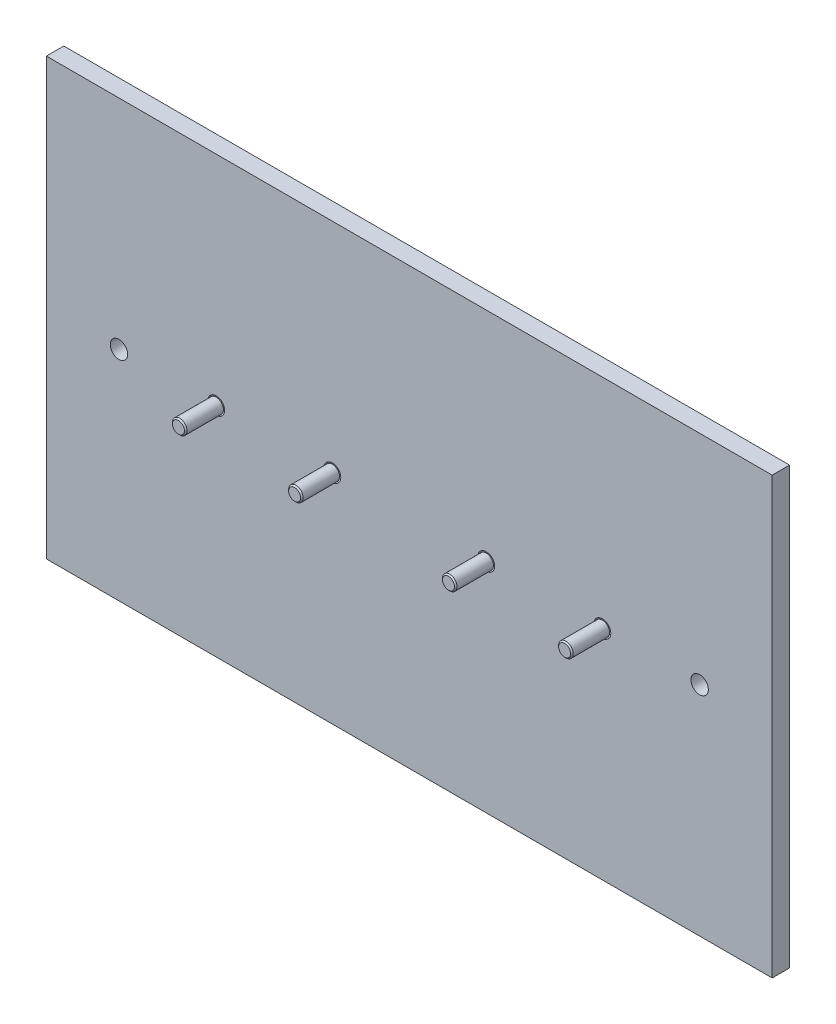
ISO-10303-21;
HEADER;
FILE_DESCRIPTION(('STEP AP214'),'2;1');
FILE_NAME('part.step','',(''),(''),'','','');
FILE_SCHEMA(('AUTOMOTIVE_DESIGN { 1 0 10303 214 1 1 1 1 }'));
ENDSEC;
DATA;
#1=APPLICATION_CONTEXT('core data for automotive mechanical design processes');
#2=APPLICATION_PROTOCOL_DEFINITION('international standard','automotive_design',2000,#1);
#3=PRODUCT_CONTEXT('',#1,'mechanical');
#4=PRODUCT('Part','Part','',(#3));
#5=PRODUCT_RELATED_PRODUCT_CATEGORY('part','',(#4));
#6=PRODUCT_DEFINITION_FORMATION('','',#4);
#7=PRODUCT_DEFINITION_CONTEXT('part definition',#1,'design');
#8=PRODUCT_DEFINITION('design','',#6,#7);
#9=PRODUCT_DEFINITION_SHAPE('','',#8);
#10=(LENGTH_UNIT() NAMED_UNIT(*) SI_UNIT(.MILLI.,.METRE.));
#11=(NAMED_UNIT(*) PLANE_ANGLE_UNIT() SI_UNIT($,.RADIAN.));
#12=(NAMED_UNIT(*) SI_UNIT($,.STERADIAN.) SOLID_ANGLE_UNIT());
#13=UNCERTAINTY_MEASURE_WITH_UNIT(LENGTH_MEASURE(1.E-05),#10,'distance_accuracy_value','');
#14=(GEOMETRIC_REPRESENTATION_CONTEXT(3) GLOBAL_UNCERTAINTY_ASSIGNED_CONTEXT((#13)) GLOBAL_UNIT_ASSIGNED_CONTEXT((#10,
#11,#12)) REPRESENTATION_CONTEXT('',''));
#15=CARTESIAN_POINT('',(0.,0.,0.));
#16=DIRECTION('',(0.,0.,1.));
#17=DIRECTION('',(1.,0.,0.));
#18=AXIS2_PLACEMENT_3D('',#15,#16,#17);
#19=CARTESIAN_POINT('',(98.5,75.,0.));
#20=DIRECTION('',(0.,0.,1.));
#21=DIRECTION('',(1.,0.,0.));
#22=AXIS2_PLACEMENT_3D('',#19,#20,#21);
#23=PLANE('',#22);
#24=CARTESIAN_POINT('',(98.5,75.,0.));
#25=DIRECTION('',(0.,0.,-1.));
#26=DIRECTION('',(-1.,0.,0.));
#27=AXIS2_PLACEMENT_3D('',#24,#25,#26);
#28=CIRCLE('',#27,2.5);
#29=CARTESIAN_POINT('',(96.,75.,0.));
#30=VERTEX_POINT('',#29);
#31=EDGE_CURVE('E11',#30,#30,#28,.T.);
#32=ORIENTED_EDGE('',*,*,#31,.T.);
#33=EDGE_LOOP('',(#32));
#34=FACE_BOUND('',#33,.T.);
#35=ADVANCED_FACE('F54',(#34),#23,.F.);
#36=CARTESIAN_POINT('',(98.5,75.,13.));
#37=DIRECTION('',(0.,0.,-1.));
#38=DIRECTION('',(-1.,0.,0.));
#39=AXIS2_PLACEMENT_3D('',#36,#37,#38);
#40=CYLINDRICAL_SURFACE('',#39,2.5);
#41=ORIENTED_EDGE('',*,*,#31,.F.);
#42=EDGE_LOOP('',(#41));
#43=FACE_BOUND('',#42,.T.);
#44=CARTESIAN_POINT('',(98.5,75.,12.555));
#45=DIRECTION('',(0.,0.,-1.));
#46=DIRECTION('',(-1.,0.,0.));
#47=AXIS2_PLACEMENT_3D('',#44,#45,#46);
#48=CIRCLE('',#47,2.5);
#49=CARTESIAN_POINT('',(96.,75.,12.555));
#50=VERTEX_POINT('',#49);
#51=EDGE_CURVE('E68',#50,#50,#48,.T.);
#52=ORIENTED_EDGE('',*,*,#51,.T.);
#53=EDGE_LOOP('',(#52));
#54=FACE_BOUND('',#53,.T.);
#55=ADVANCED_FACE('F78',(#43,#54),#40,.T.);
#56=CARTESIAN_POINT('',(98.5,75.,13.));
#57=DIRECTION('',(0.,0.,-1.));
#58=DIRECTION('',(-1.,0.,0.));
#59=AXIS2_PLACEMENT_3D('',#56,#57,#58);
#60=CONICAL_SURFACE('',#59,2.055,0.785398163397452);
#61=ORIENTED_EDGE('',*,*,#51,.F.);
#62=EDGE_LOOP('',(#61));
#63=FACE_BOUND('',#62,.T.);
#64=CARTESIAN_POINT('',(98.5,75.,13.));
#65=DIRECTION('',(0.,0.,-1.));
#66=DIRECTION('',(-1.,0.,0.));
#67=AXIS2_PLACEMENT_3D('',#64,#65,#66);
#68=CIRCLE('',#67,2.055);
#69=CARTESIAN_POINT('',(96.445,75.,13.));
#70=VERTEX_POINT('',#69);
#71=EDGE_CURVE('E62',#70,#70,#68,.T.);
#72=ORIENTED_EDGE('',*,*,#71,.T.);
#73=EDGE_LOOP('',(#72));
#74=FACE_BOUND('',#73,.T.);
#75=ADVANCED_FACE('F80',(#63,#74),#60,.T.);
#76=CARTESIAN_POINT('',(98.5,75.,13.));
#77=DIRECTION('',(0.,0.,1.));
#78=DIRECTION('',(1.,0.,0.));
#79=AXIS2_PLACEMENT_3D('',#76,#77,#78);
#80=PLANE('',#79);
#81=ORIENTED_EDGE('',*,*,#71,.F.);
#82=EDGE_LOOP('',(#81));
#83=FACE_BOUND('',#82,.T.);
#84=ADVANCED_FACE('F56',(#83),#80,.T.);
#85=CLOSED_SHELL('',(#35,#55,#75,#84));
#86=MANIFOLD_SOLID_BREP('B2',#85);
#87=CARTESIAN_POINT('',(0.,0.,0.));
#88=DIRECTION('',(0.,0.,1.));
#89=DIRECTION('',(1.,0.,0.));
#90=AXIS2_PLACEMENT_3D('',#87,#88,#89);
#91=PLANE('',#90);
#92=CARTESIAN_POINT('',(191.5,75.,0.));
#93=DIRECTION('',(0.,0.,-1.));
#94=DIRECTION('',(-1.,0.,0.));
#95=AXIS2_PLACEMENT_3D('',#92,#93,#94);
#96=CIRCLE('',#95,2.5);
#97=CARTESIAN_POINT('',(189.,75.,0.));
#98=VERTEX_POINT('',#97);
#99=EDGE_CURVE('E53',#98,#98,#96,.T.);
#100=ORIENTED_EDGE('',*,*,#99,.T.);
#101=EDGE_LOOP('',(#100));
#102=FACE_BOUND('',#101,.T.);
#103=ADVANCED_FACE('F132',(#102),#91,.F.);
#104=CARTESIAN_POINT('',(191.5,75.,13.));
#105=DIRECTION('',(0.,0.,-1.));
#106=DIRECTION('',(-1.,0.,0.));
#107=AXIS2_PLACEMENT_3D('',#104,#105,#106);
#108=CYLINDRICAL_SURFACE('',#107,2.5);
#109=ORIENTED_EDGE('',*,*,#99,.F.);
#110=EDGE_LOOP('',(#109));
#111=FACE_BOUND('',#110,.T.);
#112=CARTESIAN_POINT('',(191.5,75.,12.555));
#113=DIRECTION('',(0.,0.,-1.));
#114=DIRECTION('',(-1.,0.,0.));
#115=AXIS2_PLACEMENT_3D('',#112,#113,#114);
#116=CIRCLE('',#115,2.5);
#117=CARTESIAN_POINT('',(189.,75.,12.555));
#118=VERTEX_POINT('',#117);
#119=EDGE_CURVE('E146',#118,#118,#116,.T.);
#120=ORIENTED_EDGE('',*,*,#119,.T.);
#121=EDGE_LOOP('',(#120));
#122=FACE_BOUND('',#121,.T.);
#123=ADVANCED_FACE('F156',(#111,#122),#108,.T.);
#124=CARTESIAN_POINT('',(191.5,75.,13.));
#125=DIRECTION('',(0.,0.,-1.));
#126=DIRECTION('',(-1.,0.,0.));
#127=AXIS2_PLACEMENT_3D('',#124,#125,#126);
#128=CONICAL_SURFACE('',#127,2.055,0.785398163397452);
#129=ORIENTED_EDGE('',*,*,#119,.F.);
#130=EDGE_LOOP('',(#129));
#131=FACE_BOUND('',#130,.T.);
#132=CARTESIAN_POINT('',(191.5,75.,13.));
#133=DIRECTION('',(0.,0.,-1.));
#134=DIRECTION('',(-1.,0.,0.));
#135=AXIS2_PLACEMENT_3D('',#132,#133,#134);
#136=CIRCLE('',#135,2.055);
#137=CARTESIAN_POINT('',(189.445,75.,13.));
#138=VERTEX_POINT('',#137);
#139=EDGE_CURVE('E140',#138,#138,#136,.T.);
#140=ORIENTED_EDGE('',*,*,#139,.T.);
#141=EDGE_LOOP('',(#140));
#142=FACE_BOUND('',#141,.T.);
#143=ADVANCED_FACE('F158',(#131,#142),#128,.T.);
#144=CARTESIAN_POINT('',(0.,0.,13.));
#145=DIRECTION('',(0.,0.,1.));
#146=DIRECTION('',(1.,0.,0.));
#147=AXIS2_PLACEMENT_3D('',#144,#145,#146);
#148=PLANE('',#147);
#149=ORIENTED_EDGE('',*,*,#139,.F.);
#150=EDGE_LOOP('',(#149));
#151=FACE_BOUND('',#150,.T.);
#152=ADVANCED_FACE('F134',(#151),#148,.T.);
#153=CLOSED_SHELL('',(#103,#123,#143,#152));
#154=MANIFOLD_SOLID_BREP('B6',#153);
#155=CARTESIAN_POINT('',(0.,0.,0.));
#156=DIRECTION('',(0.,0.,1.));
#157=DIRECTION('',(1.,0.,0.));
#158=AXIS2_PLACEMENT_3D('',#155,#156,#157);
#159=PLANE('',#158);
#160=CARTESIAN_POINT('',(151.5,75.,0.));
#161=DIRECTION('',(0.,0.,-1.));
#162=DIRECTION('',(-1.,0.,0.));
#163=AXIS2_PLACEMENT_3D('',#160,#161,#162);
#164=CIRCLE('',#163,2.5);
#165=CARTESIAN_POINT('',(149.,75.,0.));
#166=VERTEX_POINT('',#165);
#167=EDGE_CURVE('E131',#166,#166,#164,.T.);
#168=ORIENTED_EDGE('',*,*,#167,.T.);
#169=EDGE_LOOP('',(#168));
#170=FACE_BOUND('',#169,.T.);
#171=ADVANCED_FACE('F208',(#170),#159,.F.);
#172=CARTESIAN_POINT('',(151.5,75.,13.));
#173=DIRECTION('',(0.,0.,-1.));
#174=DIRECTION('',(-1.,0.,0.));
#175=AXIS2_PLACEMENT_3D('',#172,#173,#174);
#176=CYLINDRICAL_SURFACE('',#175,2.5);
#177=ORIENTED_EDGE('',*,*,#167,.F.);
#178=EDGE_LOOP('',(#177));
#179=FACE_BOUND('',#178,.T.);
#180=CARTESIAN_POINT('',(151.5,75.,12.567));
#181=DIRECTION('',(0.,0.,-1.));
#182=DIRECTION('',(-1.,0.,0.));
#183=AXIS2_PLACEMENT_3D('',#180,#181,#182);
#184=CIRCLE('',#183,2.5);
#185=CARTESIAN_POINT('',(149.,75.,12.567));
#186=VERTEX_POINT('',#185);
#187=EDGE_CURVE('E222',#186,#186,#184,.T.);
#188=ORIENTED_EDGE('',*,*,#187,.T.);
#189=EDGE_LOOP('',(#188));
#190=FACE_BOUND('',#189,.T.);
#191=ADVANCED_FACE('F232',(#179,#190),#176,.T.);
#192=CARTESIAN_POINT('',(151.5,75.,13.));
#193=DIRECTION('',(0.,0.,-1.));
#194=DIRECTION('',(-1.,0.,0.));
#195=AXIS2_PLACEMENT_3D('',#192,#193,#194);
#196=CONICAL_SURFACE('',#195,2.06700000000001,0.785398163397438);
#197=ORIENTED_EDGE('',*,*,#187,.F.);
#198=EDGE_LOOP('',(#197));
#199=FACE_BOUND('',#198,.T.);
#200=CARTESIAN_POINT('',(151.5,75.,13.));
#201=DIRECTION('',(0.,0.,-1.));
#202=DIRECTION('',(-1.,0.,0.));
#203=AXIS2_PLACEMENT_3D('',#200,#201,#202);
#204=CIRCLE('',#203,2.06700000000001);
#205=CARTESIAN_POINT('',(149.433,75.,13.));
#206=VERTEX_POINT('',#205);
#207=EDGE_CURVE('E216',#206,#206,#204,.T.);
#208=ORIENTED_EDGE('',*,*,#207,.T.);
#209=EDGE_LOOP('',(#208));
#210=FACE_BOUND('',#209,.T.);
#211=ADVANCED_FACE('F234',(#199,#210),#196,.T.);
#212=CARTESIAN_POINT('',(0.,0.,13.));
#213=DIRECTION('',(0.,0.,1.));
#214=DIRECTION('',(1.,0.,0.));
#215=AXIS2_PLACEMENT_3D('',#212,#213,#214);
#216=PLANE('',#215);
#217=ORIENTED_EDGE('',*,*,#207,.F.);
#218=EDGE_LOOP('',(#217));
#219=FACE_BOUND('',#218,.T.);
#220=ADVANCED_FACE('F210',(#219),#216,.T.);
#221=CLOSED_SHELL('',(#171,#191,#211,#220));
#222=MANIFOLD_SOLID_BREP('B48',#221);
#223=CARTESIAN_POINT('',(0.,0.,0.));
#224=DIRECTION('',(0.,0.,1.));
#225=DIRECTION('',(1.,0.,0.));
#226=AXIS2_PLACEMENT_3D('',#223,#224,#225);
#227=PLANE('',#226);
#228=CARTESIAN_POINT('',(58.5,75.,0.));
#229=DIRECTION('',(0.,0.,-1.));
#230=DIRECTION('',(-1.,0.,0.));
#231=AXIS2_PLACEMENT_3D('',#228,#229,#230);
#232=CIRCLE('',#231,2.5);
#233=CARTESIAN_POINT('',(56.,75.,0.));
#234=VERTEX_POINT('',#233);
#235=EDGE_CURVE('E207',#234,#234,#232,.T.);
#236=ORIENTED_EDGE('',*,*,#235,.T.);
#237=EDGE_LOOP('',(#236));
#238=FACE_BOUND('',#237,.T.);
#239=ADVANCED_FACE('F287',(#238),#227,.F.);
#240=CARTESIAN_POINT('',(58.5,75.,13.));
#241=DIRECTION('',(0.,0.,-1.));
#242=DIRECTION('',(-1.,0.,0.));
#243=AXIS2_PLACEMENT_3D('',#240,#241,#242);
#244=CYLINDRICAL_SURFACE('',#243,2.5);
#245=ORIENTED_EDGE('',*,*,#235,.F.);
#246=EDGE_LOOP('',(#245));
#247=FACE_BOUND('',#246,.T.);
#248=CARTESIAN_POINT('',(58.5,75.,12.555));
#249=DIRECTION('',(0.,0.,-1.));
#250=DIRECTION('',(-1.,0.,0.));
#251=AXIS2_PLACEMENT_3D('',#248,#249,#250);
#252=CIRCLE('',#251,2.5);
#253=CARTESIAN_POINT('',(56.,75.,12.555));
#254=VERTEX_POINT('',#253);
#255=EDGE_CURVE('E300',#254,#254,#252,.T.);
#256=ORIENTED_EDGE('',*,*,#255,.T.);
#257=EDGE_LOOP('',(#256));
#258=FACE_BOUND('',#257,.T.);
#259=ADVANCED_FACE('F310',(#247,#258),#244,.T.);
#260=CARTESIAN_POINT('',(58.5,75.,13.));
#261=DIRECTION('',(0.,0.,-1.));
#262=DIRECTION('',(-1.,0.,0.));
#263=AXIS2_PLACEMENT_3D('',#260,#261,#262);
#264=CONICAL_SURFACE('',#263,2.055,0.785398163397445);
#265=ORIENTED_EDGE('',*,*,#255,.F.);
#266=EDGE_LOOP('',(#265));
#267=FACE_BOUND('',#266,.T.);
#268=CARTESIAN_POINT('',(58.5,75.,13.));
#269=DIRECTION('',(0.,0.,-1.));
#270=DIRECTION('',(-1.,0.,0.));
#271=AXIS2_PLACEMENT_3D('',#268,#269,#270);
#272=CIRCLE('',#271,2.055);
#273=CARTESIAN_POINT('',(56.445,75.,13.));
#274=VERTEX_POINT('',#273);
#275=EDGE_CURVE('E294',#274,#274,#272,.T.);
#276=ORIENTED_EDGE('',*,*,#275,.T.);
#277=EDGE_LOOP('',(#276));
#278=FACE_BOUND('',#277,.T.);
#279=ADVANCED_FACE('F312',(#267,#278),#264,.T.);
#280=CARTESIAN_POINT('',(0.,0.,13.));
#281=DIRECTION('',(0.,0.,1.));
#282=DIRECTION('',(1.,0.,0.));
#283=AXIS2_PLACEMENT_3D('',#280,#281,#282);
#284=PLANE('',#283);
#285=ORIENTED_EDGE('',*,*,#275,.F.);
#286=EDGE_LOOP('',(#285));
#287=FACE_BOUND('',#286,.T.);
#288=ADVANCED_FACE('F314',(#287),#284,.T.);
#289=CLOSED_SHELL('',(#239,#259,#279,#288));
#290=MANIFOLD_SOLID_BREP('B126',#289);
#291=CARTESIAN_POINT('',(0.,0.,-6.));
#292=DIRECTION('',(-1.,0.,0.));
#293=DIRECTION('',(0.,0.,1.));
#294=AXIS2_PLACEMENT_3D('',#291,#292,#293);
#295=PLANE('',#294);
#296=DIRECTION('',(0.,-1.,0.));
#297=VECTOR('',#296,1.);
#298=CARTESIAN_POINT('',(0.,0.,0.));
#299=LINE('',#298,#297);
#300=CARTESIAN_POINT('',(0.,150.,0.));
#301=VERTEX_POINT('',#300);
#302=CARTESIAN_POINT('',(0.,0.,0.));
#303=VERTEX_POINT('',#302);
#304=EDGE_CURVE('E429',#301,#303,#299,.T.);
#305=ORIENTED_EDGE('',*,*,#304,.F.);
#306=DIRECTION('',(0.,0.,1.));
#307=VECTOR('',#306,1.);
#308=CARTESIAN_POINT('',(0.,150.,-6.));
#309=LINE('',#308,#307);
#310=CARTESIAN_POINT('',(0.,150.,-6.));
#311=VERTEX_POINT('',#310);
#312=EDGE_CURVE('E285',#311,#301,#309,.T.);
#313=ORIENTED_EDGE('',*,*,#312,.F.);
#314=DIRECTION('',(0.,-1.,0.));
#315=VECTOR('',#314,1.);
#316=CARTESIAN_POINT('',(0.,0.,-6.));
#317=LINE('',#316,#315);
#318=CARTESIAN_POINT('',(0.,0.,-6.));
#319=VERTEX_POINT('',#318);
#320=EDGE_CURVE('E419',#311,#319,#317,.T.);
#321=ORIENTED_EDGE('',*,*,#320,.T.);
#322=DIRECTION('',(0.,0.,1.));
#323=VECTOR('',#322,1.);
#324=CARTESIAN_POINT('',(0.,0.,-6.));
#325=LINE('',#324,#323);
#326=EDGE_CURVE('E360',#319,#303,#325,.T.);
#327=ORIENTED_EDGE('',*,*,#326,.T.);
#328=EDGE_LOOP('',(#305,#313,#321,#327));
#329=FACE_BOUND('',#328,.T.);
#330=ADVANCED_FACE('F357',(#329),#295,.T.);
#331=CARTESIAN_POINT('',(0.,150.,-6.));
#332=DIRECTION('',(0.,1.,0.));
#333=DIRECTION('',(0.,0.,1.));
#334=AXIS2_PLACEMENT_3D('',#331,#332,#333);
#335=PLANE('',#334);
#336=DIRECTION('',(-1.,0.,0.));
#337=VECTOR('',#336,1.);
#338=CARTESIAN_POINT('',(0.,150.,0.));
#339=LINE('',#338,#337);
#340=CARTESIAN_POINT('',(250.,150.,0.));
#341=VERTEX_POINT('',#340);
#342=EDGE_CURVE('E423',#341,#301,#339,.T.);
#343=ORIENTED_EDGE('',*,*,#342,.F.);
#344=DIRECTION('',(0.,0.,1.));
#345=VECTOR('',#344,1.);
#346=CARTESIAN_POINT('',(250.,150.,-6.));
#347=LINE('',#346,#345);
#348=CARTESIAN_POINT('',(250.,150.,-6.));
#349=VERTEX_POINT('',#348);
#350=EDGE_CURVE('E367',#349,#341,#347,.T.);
#351=ORIENTED_EDGE('',*,*,#350,.F.);
#352=DIRECTION('',(-1.,0.,0.));
#353=VECTOR('',#352,1.);
#354=CARTESIAN_POINT('',(0.,150.,-6.));
#355=LINE('',#354,#353);
#356=EDGE_CURVE('E414',#349,#311,#355,.T.);
#357=ORIENTED_EDGE('',*,*,#356,.T.);
#358=ORIENTED_EDGE('',*,*,#312,.T.);
#359=EDGE_LOOP('',(#343,#351,#357,#358));
#360=FACE_BOUND('',#359,.T.);
#361=ADVANCED_FACE('F452',(#360),#335,.T.);
#362=CARTESIAN_POINT('',(250.,0.,-6.));
#363=DIRECTION('',(1.,0.,0.));
#364=DIRECTION('',(0.,0.,-1.));
#365=AXIS2_PLACEMENT_3D('',#362,#363,#364);
#366=PLANE('',#365);
#367=DIRECTION('',(0.,1.,0.));
#368=VECTOR('',#367,1.);
#369=CARTESIAN_POINT('',(250.,0.,0.));
#370=LINE('',#369,#368);
#371=CARTESIAN_POINT('',(250.,0.,0.));
#372=VERTEX_POINT('',#371);
#373=EDGE_CURVE('E408',#372,#341,#370,.T.);
#374=ORIENTED_EDGE('',*,*,#373,.F.);
#375=DIRECTION('',(0.,0.,1.));
#376=VECTOR('',#375,1.);
#377=CARTESIAN_POINT('',(250.,0.,-6.));
#378=LINE('',#377,#376);
#379=CARTESIAN_POINT('',(250.,0.,-6.));
#380=VERTEX_POINT('',#379);
#381=EDGE_CURVE('E403',#380,#372,#378,.T.);
#382=ORIENTED_EDGE('',*,*,#381,.F.);
#383=DIRECTION('',(0.,1.,0.));
#384=VECTOR('',#383,1.);
#385=CARTESIAN_POINT('',(250.,0.,-6.));
#386=LINE('',#385,#384);
#387=EDGE_CURVE('E406',#380,#349,#386,.T.);
#388=ORIENTED_EDGE('',*,*,#387,.T.);
#389=ORIENTED_EDGE('',*,*,#350,.T.);
#390=EDGE_LOOP('',(#374,#382,#388,#389));
#391=FACE_BOUND('',#390,.T.);
#392=ADVANCED_FACE('F405',(#391),#366,.T.);
#393=CARTESIAN_POINT('',(0.,0.,-6.));
#394=DIRECTION('',(0.,-1.,0.));
#395=DIRECTION('',(0.,0.,-1.));
#396=AXIS2_PLACEMENT_3D('',#393,#394,#395);
#397=PLANE('',#396);
#398=DIRECTION('',(1.,0.,0.));
#399=VECTOR('',#398,1.);
#400=CARTESIAN_POINT('',(0.,0.,0.));
#401=LINE('',#400,#399);
#402=EDGE_CURVE('E433',#303,#372,#401,.T.);
#403=ORIENTED_EDGE('',*,*,#402,.F.);
#404=ORIENTED_EDGE('',*,*,#326,.F.);
#405=DIRECTION('',(1.,0.,0.));
#406=VECTOR('',#405,1.);
#407=CARTESIAN_POINT('',(0.,0.,-6.));
#408=LINE('',#407,#406);
#409=EDGE_CURVE('E413',#319,#380,#408,.T.);
#410=ORIENTED_EDGE('',*,*,#409,.T.);
#411=ORIENTED_EDGE('',*,*,#381,.T.);
#412=EDGE_LOOP('',(#403,#404,#410,#411));
#413=FACE_BOUND('',#412,.T.);
#414=ADVANCED_FACE('F417',(#413),#397,.T.);
#415=CARTESIAN_POINT('',(0.,0.,-6.));
#416=DIRECTION('',(0.,0.,-1.));
#417=DIRECTION('',(-1.,0.,0.));
#418=AXIS2_PLACEMENT_3D('',#415,#416,#417);
#419=PLANE('',#418);
#420=CARTESIAN_POINT('',(151.5,75.,-6.));
#421=DIRECTION('',(0.,0.,1.));
#422=DIRECTION('',(-1.,0.,0.));
#423=AXIS2_PLACEMENT_3D('',#420,#421,#422);
#424=CIRCLE('',#423,2.9);
#425=CARTESIAN_POINT('',(148.6,75.,-6.));
#426=VERTEX_POINT('',#425);
#427=EDGE_CURVE('E501',#426,#426,#424,.T.);
#428=ORIENTED_EDGE('',*,*,#427,.T.);
#429=EDGE_LOOP('',(#428));
#430=FACE_BOUND('',#429,.T.);
#431=CARTESIAN_POINT('',(191.5,75.,-6.));
#432=DIRECTION('',(0.,0.,1.));
#433=DIRECTION('',(-1.,0.,0.));
#434=AXIS2_PLACEMENT_3D('',#431,#432,#433);
#435=CIRCLE('',#434,2.90000000000003);
#436=CARTESIAN_POINT('',(188.6,75.,-6.));
#437=VERTEX_POINT('',#436);
#438=EDGE_CURVE('E512',#437,#437,#435,.T.);
#439=ORIENTED_EDGE('',*,*,#438,.T.);
#440=EDGE_LOOP('',(#439));
#441=FACE_BOUND('',#440,.T.);
#442=CARTESIAN_POINT('',(58.5,75.,-6.));
#443=DIRECTION('',(0.,0.,1.));
#444=DIRECTION('',(1.,0.,0.));
#445=AXIS2_PLACEMENT_3D('',#442,#443,#444);
#446=CIRCLE('',#445,2.9);
#447=CARTESIAN_POINT('',(61.4,75.,-6.));
#448=VERTEX_POINT('',#447);
#449=EDGE_CURVE('E520',#448,#448,#446,.T.);
#450=ORIENTED_EDGE('',*,*,#449,.T.);
#451=EDGE_LOOP('',(#450));
#452=FACE_BOUND('',#451,.T.);
#453=CARTESIAN_POINT('',(98.5,75.,-6.));
#454=DIRECTION('',(0.,0.,1.));
#455=DIRECTION('',(1.,0.,0.));
#456=AXIS2_PLACEMENT_3D('',#453,#454,#455);
#457=CIRCLE('',#456,2.9);
#458=CARTESIAN_POINT('',(101.4,75.,-6.));
#459=VERTEX_POINT('',#458);
#460=EDGE_CURVE('E528',#459,#459,#457,.T.);
#461=ORIENTED_EDGE('',*,*,#460,.T.);
#462=EDGE_LOOP('',(#461));
#463=FACE_BOUND('',#462,.T.);
#464=CARTESIAN_POINT('',(225.,75.,-6.));
#465=DIRECTION('',(0.,0.,1.));
#466=DIRECTION('',(1.,0.,0.));
#467=AXIS2_PLACEMENT_3D('',#464,#465,#466);
#468=CIRCLE('',#467,2.99999999999999);
#469=CARTESIAN_POINT('',(228.,75.,-6.));
#470=VERTEX_POINT('',#469);
#471=EDGE_CURVE('E536',#470,#470,#468,.T.);
#472=ORIENTED_EDGE('',*,*,#471,.T.);
#473=EDGE_LOOP('',(#472));
#474=FACE_BOUND('',#473,.T.);
#475=CARTESIAN_POINT('',(25.,75.,-6.));
#476=DIRECTION('',(0.,0.,1.));
#477=DIRECTION('',(1.,0.,0.));
#478=AXIS2_PLACEMENT_3D('',#475,#476,#477);
#479=CIRCLE('',#478,3.);
#480=CARTESIAN_POINT('',(28.,75.,-6.));
#481=VERTEX_POINT('',#480);
#482=EDGE_CURVE('E434',#481,#481,#479,.T.);
#483=ORIENTED_EDGE('',*,*,#482,.T.);
#484=EDGE_LOOP('',(#483));
#485=FACE_BOUND('',#484,.T.);
#486=ORIENTED_EDGE('',*,*,#320,.F.);
#487=ORIENTED_EDGE('',*,*,#356,.F.);
#488=ORIENTED_EDGE('',*,*,#387,.F.);
#489=ORIENTED_EDGE('',*,*,#409,.F.);
#490=EDGE_LOOP('',(#486,#487,#488,#489));
#491=FACE_BOUND('',#490,.T.);
#492=ADVANCED_FACE('F412',(#430,#441,#452,#463,#474,#485,#491),#419,.T.);
#493=CARTESIAN_POINT('',(0.,0.,0.));
#494=DIRECTION('',(0.,0.,-1.));
#495=DIRECTION('',(-1.,0.,0.));
#496=AXIS2_PLACEMENT_3D('',#493,#494,#495);
#497=PLANE('',#496);
#498=CARTESIAN_POINT('',(151.5,75.,0.));
#499=DIRECTION('',(0.,0.,1.));
#500=DIRECTION('',(-1.,0.,0.));
#501=AXIS2_PLACEMENT_3D('',#498,#499,#500);
#502=CIRCLE('',#501,2.9);
#503=CARTESIAN_POINT('',(148.6,75.,0.));
#504=VERTEX_POINT('',#503);
#505=EDGE_CURVE('E504',#504,#504,#502,.T.);
#506=ORIENTED_EDGE('',*,*,#505,.F.);
#507=EDGE_LOOP('',(#506));
#508=FACE_BOUND('',#507,.T.);
#509=CARTESIAN_POINT('',(191.5,75.,0.));
#510=DIRECTION('',(0.,0.,1.));
#511=DIRECTION('',(-1.,0.,0.));
#512=AXIS2_PLACEMENT_3D('',#509,#510,#511);
#513=CIRCLE('',#512,2.90000000000003);
#514=CARTESIAN_POINT('',(188.6,75.,0.));
#515=VERTEX_POINT('',#514);
#516=EDGE_CURVE('E509',#515,#515,#513,.T.);
#517=ORIENTED_EDGE('',*,*,#516,.F.);
#518=EDGE_LOOP('',(#517));
#519=FACE_BOUND('',#518,.T.);
#520=CARTESIAN_POINT('',(58.5,75.,0.));
#521=DIRECTION('',(0.,0.,1.));
#522=DIRECTION('',(1.,0.,0.));
#523=AXIS2_PLACEMENT_3D('',#520,#521,#522);
#524=CIRCLE('',#523,2.9);
#525=CARTESIAN_POINT('',(61.4,75.,0.));
#526=VERTEX_POINT('',#525);
#527=EDGE_CURVE('E516',#526,#526,#524,.T.);
#528=ORIENTED_EDGE('',*,*,#527,.F.);
#529=EDGE_LOOP('',(#528));
#530=FACE_BOUND('',#529,.T.);
#531=CARTESIAN_POINT('',(98.5,75.,0.));
#532=DIRECTION('',(0.,0.,1.));
#533=DIRECTION('',(1.,0.,0.));
#534=AXIS2_PLACEMENT_3D('',#531,#532,#533);
#535=CIRCLE('',#534,2.9);
#536=CARTESIAN_POINT('',(101.4,75.,0.));
#537=VERTEX_POINT('',#536);
#538=EDGE_CURVE('E524',#537,#537,#535,.T.);
#539=ORIENTED_EDGE('',*,*,#538,.F.);
#540=EDGE_LOOP('',(#539));
#541=FACE_BOUND('',#540,.T.);
#542=CARTESIAN_POINT('',(225.,75.,0.));
#543=DIRECTION('',(0.,0.,1.));
#544=DIRECTION('',(1.,0.,0.));
#545=AXIS2_PLACEMENT_3D('',#542,#543,#544);
#546=CIRCLE('',#545,2.99999999999999);
#547=CARTESIAN_POINT('',(228.,75.,0.));
#548=VERTEX_POINT('',#547);
#549=EDGE_CURVE('E532',#548,#548,#546,.T.);
#550=ORIENTED_EDGE('',*,*,#549,.F.);
#551=EDGE_LOOP('',(#550));
#552=FACE_BOUND('',#551,.T.);
#553=CARTESIAN_POINT('',(25.,75.,0.));
#554=DIRECTION('',(0.,0.,1.));
#555=DIRECTION('',(1.,0.,0.));
#556=AXIS2_PLACEMENT_3D('',#553,#554,#555);
#557=CIRCLE('',#556,3.);
#558=CARTESIAN_POINT('',(28.,75.,0.));
#559=VERTEX_POINT('',#558);
#560=EDGE_CURVE('E540',#559,#559,#557,.T.);
#561=ORIENTED_EDGE('',*,*,#560,.F.);
#562=EDGE_LOOP('',(#561));
#563=FACE_BOUND('',#562,.T.);
#564=ORIENTED_EDGE('',*,*,#304,.T.);
#565=ORIENTED_EDGE('',*,*,#402,.T.);
#566=ORIENTED_EDGE('',*,*,#373,.T.);
#567=ORIENTED_EDGE('',*,*,#342,.T.);
#568=EDGE_LOOP('',(#564,#565,#566,#567));
#569=FACE_BOUND('',#568,.T.);
#570=ADVANCED_FACE('F451',(#508,#519,#530,#541,#552,#563,#569),#497,.F.);
#571=CARTESIAN_POINT('',(25.,75.,-6.));
#572=DIRECTION('',(0.,0.,1.));
#573=DIRECTION('',(1.,0.,0.));
#574=AXIS2_PLACEMENT_3D('',#571,#572,#573);
#575=CYLINDRICAL_SURFACE('',#574,3.);
#576=ORIENTED_EDGE('',*,*,#482,.F.);
#577=EDGE_LOOP('',(#576));
#578=FACE_BOUND('',#577,.T.);
#579=ORIENTED_EDGE('',*,*,#560,.T.);
#580=EDGE_LOOP('',(#579));
#581=FACE_BOUND('',#580,.T.);
#582=ADVANCED_FACE('F470',(#578,#581),#575,.F.);
#583=CARTESIAN_POINT('',(225.,75.,-6.));
#584=DIRECTION('',(0.,0.,1.));
#585=DIRECTION('',(1.,0.,0.));
#586=AXIS2_PLACEMENT_3D('',#583,#584,#585);
#587=CYLINDRICAL_SURFACE('',#586,2.99999999999999);
#588=ORIENTED_EDGE('',*,*,#471,.F.);
#589=EDGE_LOOP('',(#588));
#590=FACE_BOUND('',#589,.T.);
#591=ORIENTED_EDGE('',*,*,#549,.T.);
#592=EDGE_LOOP('',(#591));
#593=FACE_BOUND('',#592,.T.);
#594=ADVANCED_FACE('F477',(#590,#593),#587,.F.);
#595=CARTESIAN_POINT('',(98.5,75.,-6.));
#596=DIRECTION('',(0.,0.,1.));
#597=DIRECTION('',(1.,0.,0.));
#598=AXIS2_PLACEMENT_3D('',#595,#596,#597);
#599=CYLINDRICAL_SURFACE('',#598,2.9);
#600=ORIENTED_EDGE('',*,*,#460,.F.);
#601=EDGE_LOOP('',(#600));
#602=FACE_BOUND('',#601,.T.);
#603=ORIENTED_EDGE('',*,*,#538,.T.);
#604=EDGE_LOOP('',(#603));
#605=FACE_BOUND('',#604,.T.);
#606=ADVANCED_FACE('F481',(#602,#605),#599,.F.);
#607=CARTESIAN_POINT('',(58.5,75.,-6.));
#608=DIRECTION('',(0.,0.,1.));
#609=DIRECTION('',(1.,0.,0.));
#610=AXIS2_PLACEMENT_3D('',#607,#608,#609);
#611=CYLINDRICAL_SURFACE('',#610,2.9);
#612=ORIENTED_EDGE('',*,*,#449,.F.);
#613=EDGE_LOOP('',(#612));
#614=FACE_BOUND('',#613,.T.);
#615=ORIENTED_EDGE('',*,*,#527,.T.);
#616=EDGE_LOOP('',(#615));
#617=FACE_BOUND('',#616,.T.);
#618=ADVANCED_FACE('F485',(#614,#617),#611,.F.);
#619=CARTESIAN_POINT('',(191.5,75.,-6.));
#620=DIRECTION('',(0.,0.,1.));
#621=DIRECTION('',(1.,0.,0.));
#622=AXIS2_PLACEMENT_3D('',#619,#620,#621);
#623=CYLINDRICAL_SURFACE('',#622,2.90000000000003);
#624=ORIENTED_EDGE('',*,*,#438,.F.);
#625=EDGE_LOOP('',(#624));
#626=FACE_BOUND('',#625,.T.);
#627=ORIENTED_EDGE('',*,*,#516,.T.);
#628=EDGE_LOOP('',(#627));
#629=FACE_BOUND('',#628,.T.);
#630=ADVANCED_FACE('F489',(#626,#629),#623,.F.);
#631=CARTESIAN_POINT('',(151.5,75.,-6.));
#632=DIRECTION('',(0.,0.,1.));
#633=DIRECTION('',(1.,0.,0.));
#634=AXIS2_PLACEMENT_3D('',#631,#632,#633);
#635=CYLINDRICAL_SURFACE('',#634,2.9);
#636=ORIENTED_EDGE('',*,*,#427,.F.);
#637=EDGE_LOOP('',(#636));
#638=FACE_BOUND('',#637,.T.);
#639=ORIENTED_EDGE('',*,*,#505,.T.);
#640=EDGE_LOOP('',(#639));
#641=FACE_BOUND('',#640,.T.);
#642=ADVANCED_FACE('F493',(#638,#641),#635,.F.);
#643=CLOSED_SHELL('',(#330,#361,#392,#414,#492,#570,#582,#594,#606,#618,#630,#642));
#644=MANIFOLD_SOLID_BREP('B202',#643);
#645=ADVANCED_BREP_SHAPE_REPRESENTATION('',(#18,#86,#154,#222,#290,#644),#14);
#646=SHAPE_DEFINITION_REPRESENTATION(#9,#645);
ENDSEC;
END-ISO-10303-21;
